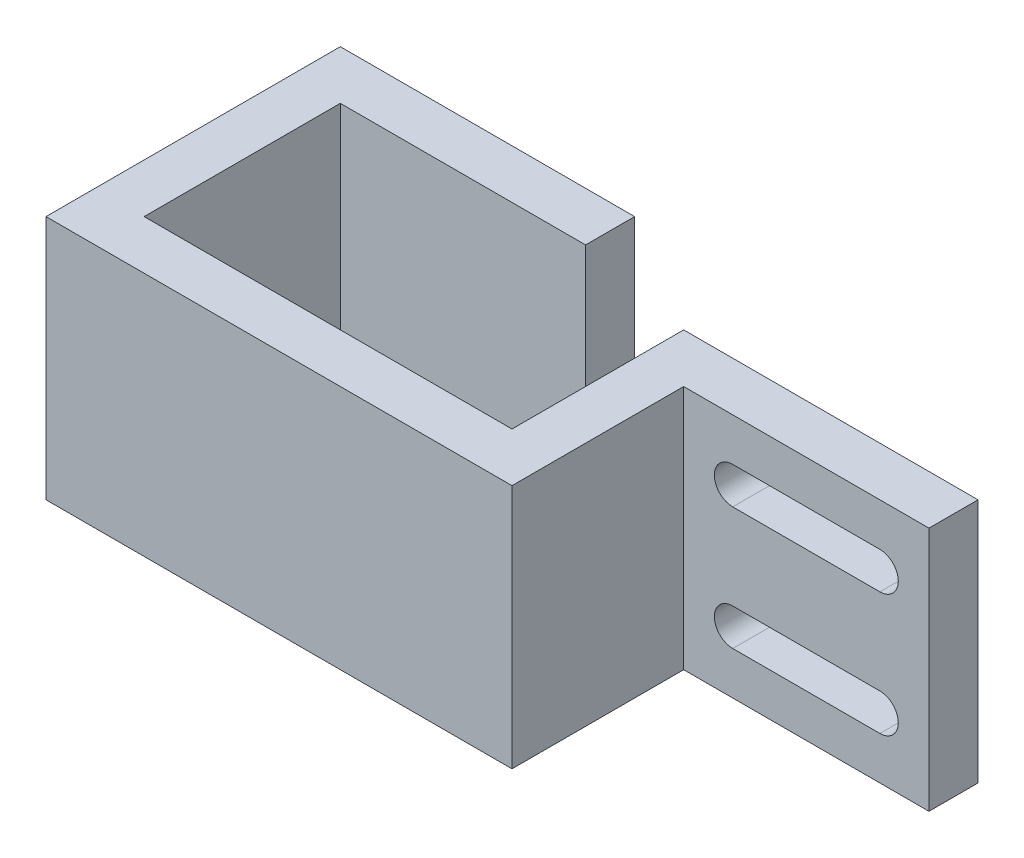
ISO-10303-21;
HEADER;
FILE_DESCRIPTION(('STEP AP214'),'2;1');
FILE_NAME('part.step','',(''),(''),'','','');
FILE_SCHEMA(('AUTOMOTIVE_DESIGN { 1 0 10303 214 1 1 1 1 }'));
ENDSEC;
DATA;
#1=APPLICATION_CONTEXT('core data for automotive mechanical design processes');
#2=APPLICATION_PROTOCOL_DEFINITION('international standard','automotive_design',2000,#1);
#3=PRODUCT_CONTEXT('',#1,'mechanical');
#4=PRODUCT('Part','Part','',(#3));
#5=PRODUCT_RELATED_PRODUCT_CATEGORY('part','',(#4));
#6=PRODUCT_DEFINITION_FORMATION('','',#4);
#7=PRODUCT_DEFINITION_CONTEXT('part definition',#1,'design');
#8=PRODUCT_DEFINITION('design','',#6,#7);
#9=PRODUCT_DEFINITION_SHAPE('','',#8);
#10=(LENGTH_UNIT() NAMED_UNIT(*) SI_UNIT(.MILLI.,.METRE.));
#11=(NAMED_UNIT(*) PLANE_ANGLE_UNIT() SI_UNIT($,.RADIAN.));
#12=(NAMED_UNIT(*) SI_UNIT($,.STERADIAN.) SOLID_ANGLE_UNIT());
#13=UNCERTAINTY_MEASURE_WITH_UNIT(LENGTH_MEASURE(1.E-05),#10,'distance_accuracy_value','');
#14=(GEOMETRIC_REPRESENTATION_CONTEXT(3) GLOBAL_UNCERTAINTY_ASSIGNED_CONTEXT((#13)) GLOBAL_UNIT_ASSIGNED_CONTEXT((#10,
#11,#12)) REPRESENTATION_CONTEXT('',''));
#15=CARTESIAN_POINT('',(0.,0.,0.));
#16=DIRECTION('',(0.,0.,1.));
#17=DIRECTION('',(1.,0.,0.));
#18=AXIS2_PLACEMENT_3D('',#15,#16,#17);
#19=CARTESIAN_POINT('',(-15.,20.,-24.));
#20=DIRECTION('',(-1.,0.,0.));
#21=DIRECTION('',(0.,0.,1.));
#22=AXIS2_PLACEMENT_3D('',#19,#20,#21);
#23=PLANE('',#22);
#24=DIRECTION('',(0.,-1.,0.));
#25=VECTOR('',#24,1.);
#26=CARTESIAN_POINT('',(-15.,20.,-20.));
#27=LINE('',#26,#25);
#28=CARTESIAN_POINT('',(-15.,20.,-20.));
#29=VERTEX_POINT('',#28);
#30=CARTESIAN_POINT('',(-15.,0.,-20.));
#31=VERTEX_POINT('',#30);
#32=EDGE_CURVE('E48',#29,#31,#27,.T.);
#33=ORIENTED_EDGE('',*,*,#32,.F.);
#34=DIRECTION('',(0.,0.,-1.));
#35=VECTOR('',#34,1.);
#36=CARTESIAN_POINT('',(-15.,20.,-24.));
#37=LINE('',#36,#35);
#38=CARTESIAN_POINT('',(-15.,20.,-4.));
#39=VERTEX_POINT('',#38);
#40=EDGE_CURVE('E180',#39,#29,#37,.T.);
#41=ORIENTED_EDGE('',*,*,#40,.F.);
#42=DIRECTION('',(0.,-1.,0.));
#43=VECTOR('',#42,1.);
#44=CARTESIAN_POINT('',(-15.,20.,-4.));
#45=LINE('',#44,#43);
#46=CARTESIAN_POINT('',(-15.,0.,-4.));
#47=VERTEX_POINT('',#46);
#48=EDGE_CURVE('E282',#39,#47,#45,.T.);
#49=ORIENTED_EDGE('',*,*,#48,.T.);
#50=DIRECTION('',(0.,0.,-1.));
#51=VECTOR('',#50,1.);
#52=CARTESIAN_POINT('',(-15.,0.,-24.));
#53=LINE('',#52,#51);
#54=EDGE_CURVE('E53',#47,#31,#53,.T.);
#55=ORIENTED_EDGE('',*,*,#54,.T.);
#56=EDGE_LOOP('',(#33,#41,#49,#55));
#57=FACE_BOUND('',#56,.T.);
#58=ADVANCED_FACE('F33',(#57),#23,.F.);
#59=CARTESIAN_POINT('',(-19.,20.,0.));
#60=DIRECTION('',(1.,0.,0.));
#61=DIRECTION('',(0.,0.,-1.));
#62=AXIS2_PLACEMENT_3D('',#59,#60,#61);
#63=PLANE('',#62);
#64=DIRECTION('',(0.,0.,1.));
#65=VECTOR('',#64,1.);
#66=CARTESIAN_POINT('',(-19.,0.,0.));
#67=LINE('',#66,#65);
#68=CARTESIAN_POINT('',(-19.,0.,-24.));
#69=VERTEX_POINT('',#68);
#70=CARTESIAN_POINT('',(-19.,0.,0.));
#71=VERTEX_POINT('',#70);
#72=EDGE_CURVE('E220',#69,#71,#67,.T.);
#73=ORIENTED_EDGE('',*,*,#72,.T.);
#74=DIRECTION('',(0.,-1.,0.));
#75=VECTOR('',#74,1.);
#76=CARTESIAN_POINT('',(-19.,20.,0.));
#77=LINE('',#76,#75);
#78=CARTESIAN_POINT('',(-19.,20.,0.));
#79=VERTEX_POINT('',#78);
#80=EDGE_CURVE('E302',#79,#71,#77,.T.);
#81=ORIENTED_EDGE('',*,*,#80,.F.);
#82=DIRECTION('',(0.,0.,1.));
#83=VECTOR('',#82,1.);
#84=CARTESIAN_POINT('',(-19.,20.,0.));
#85=LINE('',#84,#83);
#86=CARTESIAN_POINT('',(-19.,20.,-24.));
#87=VERTEX_POINT('',#86);
#88=EDGE_CURVE('E245',#87,#79,#85,.T.);
#89=ORIENTED_EDGE('',*,*,#88,.F.);
#90=DIRECTION('',(0.,-1.,0.));
#91=VECTOR('',#90,1.);
#92=CARTESIAN_POINT('',(-19.,20.,-24.));
#93=LINE('',#92,#91);
#94=EDGE_CURVE('E176',#87,#69,#93,.T.);
#95=ORIENTED_EDGE('',*,*,#94,.T.);
#96=EDGE_LOOP('',(#73,#81,#89,#95));
#97=FACE_BOUND('',#96,.T.);
#98=ADVANCED_FACE('F35',(#97),#63,.F.);
#99=CARTESIAN_POINT('',(19.,20.,0.));
#100=DIRECTION('',(0.,0.,-1.));
#101=DIRECTION('',(-1.,0.,0.));
#102=AXIS2_PLACEMENT_3D('',#99,#100,#101);
#103=PLANE('',#102);
#104=DIRECTION('',(1.,0.,0.));
#105=VECTOR('',#104,1.);
#106=CARTESIAN_POINT('',(19.,0.,0.));
#107=LINE('',#106,#105);
#108=CARTESIAN_POINT('',(19.,0.,0.));
#109=VERTEX_POINT('',#108);
#110=EDGE_CURVE('E265',#71,#109,#107,.T.);
#111=ORIENTED_EDGE('',*,*,#110,.T.);
#112=DIRECTION('',(0.,-1.,0.));
#113=VECTOR('',#112,1.);
#114=CARTESIAN_POINT('',(19.,20.,0.));
#115=LINE('',#114,#113);
#116=CARTESIAN_POINT('',(19.,20.,0.));
#117=VERTEX_POINT('',#116);
#118=EDGE_CURVE('E299',#117,#109,#115,.T.);
#119=ORIENTED_EDGE('',*,*,#118,.F.);
#120=DIRECTION('',(1.,0.,0.));
#121=VECTOR('',#120,1.);
#122=CARTESIAN_POINT('',(19.,20.,0.));
#123=LINE('',#122,#121);
#124=EDGE_CURVE('E247',#79,#117,#123,.T.);
#125=ORIENTED_EDGE('',*,*,#124,.F.);
#126=ORIENTED_EDGE('',*,*,#80,.T.);
#127=EDGE_LOOP('',(#111,#119,#125,#126));
#128=FACE_BOUND('',#127,.T.);
#129=ADVANCED_FACE('F361',(#128),#103,.F.);
#130=CARTESIAN_POINT('',(19.,20.,-14.));
#131=DIRECTION('',(-1.,0.,0.));
#132=DIRECTION('',(0.,0.,1.));
#133=AXIS2_PLACEMENT_3D('',#130,#131,#132);
#134=PLANE('',#133);
#135=DIRECTION('',(0.,0.,-1.));
#136=VECTOR('',#135,1.);
#137=CARTESIAN_POINT('',(19.,0.,-14.));
#138=LINE('',#137,#136);
#139=CARTESIAN_POINT('',(19.,0.,-14.));
#140=VERTEX_POINT('',#139);
#141=EDGE_CURVE('E267',#109,#140,#138,.T.);
#142=ORIENTED_EDGE('',*,*,#141,.T.);
#143=DIRECTION('',(0.,-1.,0.));
#144=VECTOR('',#143,1.);
#145=CARTESIAN_POINT('',(19.,20.,-14.));
#146=LINE('',#145,#144);
#147=CARTESIAN_POINT('',(19.,20.,-14.));
#148=VERTEX_POINT('',#147);
#149=EDGE_CURVE('E296',#148,#140,#146,.T.);
#150=ORIENTED_EDGE('',*,*,#149,.F.);
#151=DIRECTION('',(0.,0.,-1.));
#152=VECTOR('',#151,1.);
#153=CARTESIAN_POINT('',(19.,20.,-14.));
#154=LINE('',#153,#152);
#155=EDGE_CURVE('E250',#117,#148,#154,.T.);
#156=ORIENTED_EDGE('',*,*,#155,.F.);
#157=ORIENTED_EDGE('',*,*,#118,.T.);
#158=EDGE_LOOP('',(#142,#150,#156,#157));
#159=FACE_BOUND('',#158,.T.);
#160=ADVANCED_FACE('F382',(#159),#134,.F.);
#161=CARTESIAN_POINT('',(39.,20.,-14.));
#162=DIRECTION('',(0.,0.,-1.));
#163=DIRECTION('',(-1.,0.,0.));
#164=AXIS2_PLACEMENT_3D('',#161,#162,#163);
#165=PLANE('',#164);
#166=DIRECTION('',(-1.,0.,0.));
#167=VECTOR('',#166,1.);
#168=CARTESIAN_POINT('',(35.,16.5,-14.));
#169=LINE('',#168,#167);
#170=CARTESIAN_POINT('',(35.,16.5,-14.));
#171=VERTEX_POINT('',#170);
#172=CARTESIAN_POINT('',(23.,16.5,-14.));
#173=VERTEX_POINT('',#172);
#174=EDGE_CURVE('E207',#171,#173,#169,.T.);
#175=ORIENTED_EDGE('',*,*,#174,.F.);
#176=CARTESIAN_POINT('',(35.,15.,-14.));
#177=DIRECTION('',(0.,0.,1.));
#178=DIRECTION('',(1.,0.,0.));
#179=AXIS2_PLACEMENT_3D('',#176,#177,#178);
#180=CIRCLE('',#179,1.5);
#181=CARTESIAN_POINT('',(35.,13.5,-14.));
#182=VERTEX_POINT('',#181);
#183=EDGE_CURVE('E205',#182,#171,#180,.T.);
#184=ORIENTED_EDGE('',*,*,#183,.F.);
#185=DIRECTION('',(1.,0.,0.));
#186=VECTOR('',#185,1.);
#187=CARTESIAN_POINT('',(35.,13.5,-14.));
#188=LINE('',#187,#186);
#189=CARTESIAN_POINT('',(23.,13.5,-14.));
#190=VERTEX_POINT('',#189);
#191=EDGE_CURVE('E214',#190,#182,#188,.T.);
#192=ORIENTED_EDGE('',*,*,#191,.F.);
#193=CARTESIAN_POINT('',(23.,15.,-14.));
#194=DIRECTION('',(0.,0.,1.));
#195=DIRECTION('',(-1.,0.,0.));
#196=AXIS2_PLACEMENT_3D('',#193,#194,#195);
#197=CIRCLE('',#196,1.5);
#198=EDGE_CURVE('E211',#173,#190,#197,.T.);
#199=ORIENTED_EDGE('',*,*,#198,.F.);
#200=EDGE_LOOP('',(#175,#184,#192,#199));
#201=FACE_BOUND('',#200,.T.);
#202=DIRECTION('',(-1.,0.,0.));
#203=VECTOR('',#202,1.);
#204=CARTESIAN_POINT('',(35.,6.50000000000001,-14.));
#205=LINE('',#204,#203);
#206=CARTESIAN_POINT('',(35.,6.50000000000001,-14.));
#207=VERTEX_POINT('',#206);
#208=CARTESIAN_POINT('',(23.,6.50000000000001,-14.));
#209=VERTEX_POINT('',#208);
#210=EDGE_CURVE('E228',#207,#209,#205,.T.);
#211=ORIENTED_EDGE('',*,*,#210,.F.);
#212=CARTESIAN_POINT('',(35.,5.,-14.));
#213=DIRECTION('',(0.,0.,1.));
#214=DIRECTION('',(-1.,0.,0.));
#215=AXIS2_PLACEMENT_3D('',#212,#213,#214);
#216=CIRCLE('',#215,1.5);
#217=CARTESIAN_POINT('',(35.,3.5,-14.));
#218=VERTEX_POINT('',#217);
#219=EDGE_CURVE('E204',#218,#207,#216,.T.);
#220=ORIENTED_EDGE('',*,*,#219,.F.);
#221=DIRECTION('',(1.,0.,0.));
#222=VECTOR('',#221,1.);
#223=CARTESIAN_POINT('',(35.,3.5,-14.));
#224=LINE('',#223,#222);
#225=CARTESIAN_POINT('',(23.,3.5,-14.));
#226=VERTEX_POINT('',#225);
#227=EDGE_CURVE('E234',#226,#218,#224,.T.);
#228=ORIENTED_EDGE('',*,*,#227,.F.);
#229=CARTESIAN_POINT('',(23.,5.,-14.));
#230=DIRECTION('',(0.,0.,1.));
#231=DIRECTION('',(1.,0.,0.));
#232=AXIS2_PLACEMENT_3D('',#229,#230,#231);
#233=CIRCLE('',#232,1.5);
#234=EDGE_CURVE('E231',#209,#226,#233,.T.);
#235=ORIENTED_EDGE('',*,*,#234,.F.);
#236=EDGE_LOOP('',(#211,#220,#228,#235));
#237=FACE_BOUND('',#236,.T.);
#238=DIRECTION('',(1.,0.,0.));
#239=VECTOR('',#238,1.);
#240=CARTESIAN_POINT('',(39.,0.,-14.));
#241=LINE('',#240,#239);
#242=CARTESIAN_POINT('',(39.,0.,-14.));
#243=VERTEX_POINT('',#242);
#244=EDGE_CURVE('E269',#140,#243,#241,.T.);
#245=ORIENTED_EDGE('',*,*,#244,.T.);
#246=DIRECTION('',(0.,-1.,0.));
#247=VECTOR('',#246,1.);
#248=CARTESIAN_POINT('',(39.,20.,-14.));
#249=LINE('',#248,#247);
#250=CARTESIAN_POINT('',(39.,20.,-14.));
#251=VERTEX_POINT('',#250);
#252=EDGE_CURVE('E293',#251,#243,#249,.T.);
#253=ORIENTED_EDGE('',*,*,#252,.F.);
#254=DIRECTION('',(1.,0.,0.));
#255=VECTOR('',#254,1.);
#256=CARTESIAN_POINT('',(39.,20.,-14.));
#257=LINE('',#256,#255);
#258=EDGE_CURVE('E252',#148,#251,#257,.T.);
#259=ORIENTED_EDGE('',*,*,#258,.F.);
#260=ORIENTED_EDGE('',*,*,#149,.T.);
#261=EDGE_LOOP('',(#245,#253,#259,#260));
#262=FACE_BOUND('',#261,.T.);
#263=ADVANCED_FACE('F338',(#201,#237,#262),#165,.F.);
#264=CARTESIAN_POINT('',(39.,20.,-18.));
#265=DIRECTION('',(-1.,0.,0.));
#266=DIRECTION('',(0.,0.,1.));
#267=AXIS2_PLACEMENT_3D('',#264,#265,#266);
#268=PLANE('',#267);
#269=DIRECTION('',(0.,0.,-1.));
#270=VECTOR('',#269,1.);
#271=CARTESIAN_POINT('',(39.,0.,-18.));
#272=LINE('',#271,#270);
#273=CARTESIAN_POINT('',(39.,0.,-18.));
#274=VERTEX_POINT('',#273);
#275=EDGE_CURVE('E271',#243,#274,#272,.T.);
#276=ORIENTED_EDGE('',*,*,#275,.T.);
#277=DIRECTION('',(0.,-1.,0.));
#278=VECTOR('',#277,1.);
#279=CARTESIAN_POINT('',(39.,20.,-18.));
#280=LINE('',#279,#278);
#281=CARTESIAN_POINT('',(39.,20.,-18.));
#282=VERTEX_POINT('',#281);
#283=EDGE_CURVE('E290',#282,#274,#280,.T.);
#284=ORIENTED_EDGE('',*,*,#283,.F.);
#285=DIRECTION('',(0.,0.,-1.));
#286=VECTOR('',#285,1.);
#287=CARTESIAN_POINT('',(39.,20.,-18.));
#288=LINE('',#287,#286);
#289=EDGE_CURVE('E254',#251,#282,#288,.T.);
#290=ORIENTED_EDGE('',*,*,#289,.F.);
#291=ORIENTED_EDGE('',*,*,#252,.T.);
#292=EDGE_LOOP('',(#276,#284,#290,#291));
#293=FACE_BOUND('',#292,.T.);
#294=ADVANCED_FACE('F376',(#293),#268,.F.);
#295=CARTESIAN_POINT('',(15.,20.,-18.));
#296=DIRECTION('',(0.,0.,1.));
#297=DIRECTION('',(1.,0.,0.));
#298=AXIS2_PLACEMENT_3D('',#295,#296,#297);
#299=PLANE('',#298);
#300=DIRECTION('',(1.,0.,0.));
#301=VECTOR('',#300,1.);
#302=CARTESIAN_POINT('',(15.,13.5,-18.));
#303=LINE('',#302,#301);
#304=CARTESIAN_POINT('',(23.,13.5,-18.));
#305=VERTEX_POINT('',#304);
#306=CARTESIAN_POINT('',(35.,13.5,-18.));
#307=VERTEX_POINT('',#306);
#308=EDGE_CURVE('E41',#305,#307,#303,.T.);
#309=ORIENTED_EDGE('',*,*,#308,.T.);
#310=CARTESIAN_POINT('',(35.,15.,-18.));
#311=DIRECTION('',(0.,0.,1.));
#312=DIRECTION('',(1.,0.,0.));
#313=AXIS2_PLACEMENT_3D('',#310,#311,#312);
#314=CIRCLE('',#313,1.5);
#315=CARTESIAN_POINT('',(35.,16.5,-18.));
#316=VERTEX_POINT('',#315);
#317=EDGE_CURVE('E11',#307,#316,#314,.T.);
#318=ORIENTED_EDGE('',*,*,#317,.T.);
#319=DIRECTION('',(-1.,0.,0.));
#320=VECTOR('',#319,1.);
#321=CARTESIAN_POINT('',(15.,16.5,-18.));
#322=LINE('',#321,#320);
#323=CARTESIAN_POINT('',(23.,16.5,-18.));
#324=VERTEX_POINT('',#323);
#325=EDGE_CURVE('E317',#316,#324,#322,.T.);
#326=ORIENTED_EDGE('',*,*,#325,.T.);
#327=CARTESIAN_POINT('',(23.,15.,-18.));
#328=DIRECTION('',(0.,0.,1.));
#329=DIRECTION('',(1.,0.,0.));
#330=AXIS2_PLACEMENT_3D('',#327,#328,#329);
#331=CIRCLE('',#330,1.5);
#332=EDGE_CURVE('E320',#324,#305,#331,.T.);
#333=ORIENTED_EDGE('',*,*,#332,.T.);
#334=EDGE_LOOP('',(#309,#318,#326,#333));
#335=FACE_BOUND('',#334,.T.);
#336=DIRECTION('',(1.,0.,0.));
#337=VECTOR('',#336,1.);
#338=CARTESIAN_POINT('',(15.,3.5,-18.));
#339=LINE('',#338,#337);
#340=CARTESIAN_POINT('',(23.,3.5,-18.));
#341=VERTEX_POINT('',#340);
#342=CARTESIAN_POINT('',(35.,3.5,-18.));
#343=VERTEX_POINT('',#342);
#344=EDGE_CURVE('E311',#341,#343,#339,.T.);
#345=ORIENTED_EDGE('',*,*,#344,.T.);
#346=CARTESIAN_POINT('',(35.,5.,-18.));
#347=DIRECTION('',(0.,0.,1.));
#348=DIRECTION('',(1.,0.,0.));
#349=AXIS2_PLACEMENT_3D('',#346,#347,#348);
#350=CIRCLE('',#349,1.5);
#351=CARTESIAN_POINT('',(35.,6.50000000000001,-18.));
#352=VERTEX_POINT('',#351);
#353=EDGE_CURVE('E314',#343,#352,#350,.T.);
#354=ORIENTED_EDGE('',*,*,#353,.T.);
#355=DIRECTION('',(-1.,0.,0.));
#356=VECTOR('',#355,1.);
#357=CARTESIAN_POINT('',(15.,6.50000000000001,-18.));
#358=LINE('',#357,#356);
#359=CARTESIAN_POINT('',(23.,6.50000000000001,-18.));
#360=VERTEX_POINT('',#359);
#361=EDGE_CURVE('E305',#352,#360,#358,.T.);
#362=ORIENTED_EDGE('',*,*,#361,.T.);
#363=CARTESIAN_POINT('',(23.,5.,-18.));
#364=DIRECTION('',(0.,0.,1.));
#365=DIRECTION('',(1.,0.,0.));
#366=AXIS2_PLACEMENT_3D('',#363,#364,#365);
#367=CIRCLE('',#366,1.5);
#368=EDGE_CURVE('E308',#360,#341,#367,.T.);
#369=ORIENTED_EDGE('',*,*,#368,.T.);
#370=EDGE_LOOP('',(#345,#354,#362,#369));
#371=FACE_BOUND('',#370,.T.);
#372=DIRECTION('',(-1.,0.,0.));
#373=VECTOR('',#372,1.);
#374=CARTESIAN_POINT('',(15.,0.,-18.));
#375=LINE('',#374,#373);
#376=CARTESIAN_POINT('',(15.,0.,-18.));
#377=VERTEX_POINT('',#376);
#378=EDGE_CURVE('E273',#274,#377,#375,.T.);
#379=ORIENTED_EDGE('',*,*,#378,.T.);
#380=DIRECTION('',(0.,-1.,0.));
#381=VECTOR('',#380,1.);
#382=CARTESIAN_POINT('',(15.,20.,-18.));
#383=LINE('',#382,#381);
#384=CARTESIAN_POINT('',(15.,20.,-18.));
#385=VERTEX_POINT('',#384);
#386=EDGE_CURVE('E287',#385,#377,#383,.T.);
#387=ORIENTED_EDGE('',*,*,#386,.F.);
#388=DIRECTION('',(-1.,0.,0.));
#389=VECTOR('',#388,1.);
#390=CARTESIAN_POINT('',(15.,20.,-18.));
#391=LINE('',#390,#389);
#392=EDGE_CURVE('E256',#282,#385,#391,.T.);
#393=ORIENTED_EDGE('',*,*,#392,.F.);
#394=ORIENTED_EDGE('',*,*,#283,.T.);
#395=EDGE_LOOP('',(#379,#387,#393,#394));
#396=FACE_BOUND('',#395,.T.);
#397=ADVANCED_FACE('F324',(#335,#371,#396),#299,.F.);
#398=CARTESIAN_POINT('',(15.,20.,-4.));
#399=DIRECTION('',(1.,0.,0.));
#400=DIRECTION('',(0.,0.,-1.));
#401=AXIS2_PLACEMENT_3D('',#398,#399,#400);
#402=PLANE('',#401);
#403=DIRECTION('',(0.,0.,1.));
#404=VECTOR('',#403,1.);
#405=CARTESIAN_POINT('',(15.,0.,-4.));
#406=LINE('',#405,#404);
#407=CARTESIAN_POINT('',(15.,0.,-4.));
#408=VERTEX_POINT('',#407);
#409=EDGE_CURVE('E275',#377,#408,#406,.T.);
#410=ORIENTED_EDGE('',*,*,#409,.T.);
#411=DIRECTION('',(0.,-1.,0.));
#412=VECTOR('',#411,1.);
#413=CARTESIAN_POINT('',(15.,20.,-4.));
#414=LINE('',#413,#412);
#415=CARTESIAN_POINT('',(15.,20.,-4.));
#416=VERTEX_POINT('',#415);
#417=EDGE_CURVE('E284',#416,#408,#414,.T.);
#418=ORIENTED_EDGE('',*,*,#417,.F.);
#419=DIRECTION('',(0.,0.,1.));
#420=VECTOR('',#419,1.);
#421=CARTESIAN_POINT('',(15.,20.,-4.));
#422=LINE('',#421,#420);
#423=EDGE_CURVE('E258',#385,#416,#422,.T.);
#424=ORIENTED_EDGE('',*,*,#423,.F.);
#425=ORIENTED_EDGE('',*,*,#386,.T.);
#426=EDGE_LOOP('',(#410,#418,#424,#425));
#427=FACE_BOUND('',#426,.T.);
#428=ADVANCED_FACE('F369',(#427),#402,.F.);
#429=CARTESIAN_POINT('',(-15.,20.,-4.));
#430=DIRECTION('',(0.,0.,1.));
#431=DIRECTION('',(1.,0.,0.));
#432=AXIS2_PLACEMENT_3D('',#429,#430,#431);
#433=PLANE('',#432);
#434=DIRECTION('',(-1.,0.,0.));
#435=VECTOR('',#434,1.);
#436=CARTESIAN_POINT('',(-15.,0.,-4.));
#437=LINE('',#436,#435);
#438=EDGE_CURVE('E277',#408,#47,#437,.T.);
#439=ORIENTED_EDGE('',*,*,#438,.T.);
#440=ORIENTED_EDGE('',*,*,#48,.F.);
#441=DIRECTION('',(-1.,0.,0.));
#442=VECTOR('',#441,1.);
#443=CARTESIAN_POINT('',(-15.,20.,-4.));
#444=LINE('',#443,#442);
#445=EDGE_CURVE('E260',#416,#39,#444,.T.);
#446=ORIENTED_EDGE('',*,*,#445,.F.);
#447=ORIENTED_EDGE('',*,*,#417,.T.);
#448=EDGE_LOOP('',(#439,#440,#446,#447));
#449=FACE_BOUND('',#448,.T.);
#450=ADVANCED_FACE('F366',(#449),#433,.F.);
#451=CARTESIAN_POINT('',(-19.,20.,-24.));
#452=DIRECTION('',(0.,0.,1.));
#453=DIRECTION('',(1.,0.,0.));
#454=AXIS2_PLACEMENT_3D('',#451,#452,#453);
#455=PLANE('',#454);
#456=DIRECTION('',(-1.,0.,0.));
#457=VECTOR('',#456,1.);
#458=CARTESIAN_POINT('',(-19.,0.,-24.));
#459=LINE('',#458,#457);
#460=CARTESIAN_POINT('',(5.,0.,-24.));
#461=VERTEX_POINT('',#460);
#462=EDGE_CURVE('E248',#461,#69,#459,.T.);
#463=ORIENTED_EDGE('',*,*,#462,.T.);
#464=ORIENTED_EDGE('',*,*,#94,.F.);
#465=DIRECTION('',(-1.,0.,0.));
#466=VECTOR('',#465,1.);
#467=CARTESIAN_POINT('',(-19.,20.,-24.));
#468=LINE('',#467,#466);
#469=CARTESIAN_POINT('',(5.,20.,-24.));
#470=VERTEX_POINT('',#469);
#471=EDGE_CURVE('E170',#470,#87,#468,.T.);
#472=ORIENTED_EDGE('',*,*,#471,.F.);
#473=DIRECTION('',(0.,1.,0.));
#474=VECTOR('',#473,1.);
#475=CARTESIAN_POINT('',(5.,0.,-24.));
#476=LINE('',#475,#474);
#477=EDGE_CURVE('E174',#461,#470,#476,.T.);
#478=ORIENTED_EDGE('',*,*,#477,.F.);
#479=EDGE_LOOP('',(#463,#464,#472,#478));
#480=FACE_BOUND('',#479,.T.);
#481=ADVANCED_FACE('F172',(#480),#455,.F.);
#482=CARTESIAN_POINT('',(0.,20.,0.));
#483=DIRECTION('',(0.,-1.,0.));
#484=DIRECTION('',(0.,0.,-1.));
#485=AXIS2_PLACEMENT_3D('',#482,#483,#484);
#486=PLANE('',#485);
#487=ORIENTED_EDGE('',*,*,#88,.T.);
#488=ORIENTED_EDGE('',*,*,#124,.T.);
#489=ORIENTED_EDGE('',*,*,#155,.T.);
#490=ORIENTED_EDGE('',*,*,#258,.T.);
#491=ORIENTED_EDGE('',*,*,#289,.T.);
#492=ORIENTED_EDGE('',*,*,#392,.T.);
#493=ORIENTED_EDGE('',*,*,#423,.T.);
#494=ORIENTED_EDGE('',*,*,#445,.T.);
#495=ORIENTED_EDGE('',*,*,#40,.T.);
#496=DIRECTION('',(-1.,0.,0.));
#497=VECTOR('',#496,1.);
#498=CARTESIAN_POINT('',(5.,20.,-20.));
#499=LINE('',#498,#497);
#500=CARTESIAN_POINT('',(5.,20.,-20.));
#501=VERTEX_POINT('',#500);
#502=EDGE_CURVE('E186',#501,#29,#499,.T.);
#503=ORIENTED_EDGE('',*,*,#502,.F.);
#504=DIRECTION('',(0.,0.,1.));
#505=VECTOR('',#504,1.);
#506=CARTESIAN_POINT('',(5.,20.,-24.));
#507=LINE('',#506,#505);
#508=EDGE_CURVE('E183',#470,#501,#507,.T.);
#509=ORIENTED_EDGE('',*,*,#508,.F.);
#510=ORIENTED_EDGE('',*,*,#471,.T.);
#511=EDGE_LOOP('',(#487,#488,#489,#490,#491,#492,#493,#494,#495,#503,#509,#510));
#512=FACE_BOUND('',#511,.T.);
#513=ADVANCED_FACE('F184',(#512),#486,.F.);
#514=CARTESIAN_POINT('',(0.,0.,0.));
#515=DIRECTION('',(0.,-1.,0.));
#516=DIRECTION('',(0.,0.,-1.));
#517=AXIS2_PLACEMENT_3D('',#514,#515,#516);
#518=PLANE('',#517);
#519=ORIENTED_EDGE('',*,*,#72,.F.);
#520=ORIENTED_EDGE('',*,*,#462,.F.);
#521=DIRECTION('',(0.,0.,-1.));
#522=VECTOR('',#521,1.);
#523=CARTESIAN_POINT('',(5.,0.,-20.));
#524=LINE('',#523,#522);
#525=CARTESIAN_POINT('',(5.,0.,-20.));
#526=VERTEX_POINT('',#525);
#527=EDGE_CURVE('E194',#526,#461,#524,.T.);
#528=ORIENTED_EDGE('',*,*,#527,.F.);
#529=DIRECTION('',(-1.,0.,0.));
#530=VECTOR('',#529,1.);
#531=CARTESIAN_POINT('',(5.,0.,-20.));
#532=LINE('',#531,#530);
#533=EDGE_CURVE('E199',#526,#31,#532,.T.);
#534=ORIENTED_EDGE('',*,*,#533,.T.);
#535=ORIENTED_EDGE('',*,*,#54,.F.);
#536=ORIENTED_EDGE('',*,*,#438,.F.);
#537=ORIENTED_EDGE('',*,*,#409,.F.);
#538=ORIENTED_EDGE('',*,*,#378,.F.);
#539=ORIENTED_EDGE('',*,*,#275,.F.);
#540=ORIENTED_EDGE('',*,*,#244,.F.);
#541=ORIENTED_EDGE('',*,*,#141,.F.);
#542=ORIENTED_EDGE('',*,*,#110,.F.);
#543=EDGE_LOOP('',(#519,#520,#528,#534,#535,#536,#537,#538,#539,#540,#541,#542));
#544=FACE_BOUND('',#543,.T.);
#545=ADVANCED_FACE('F397',(#544),#518,.T.);
#546=CARTESIAN_POINT('',(35.,5.,-34.));
#547=DIRECTION('',(0.,0.,1.));
#548=DIRECTION('',(1.,0.,0.));
#549=AXIS2_PLACEMENT_3D('',#546,#547,#548);
#550=CYLINDRICAL_SURFACE('',#549,1.5);
#551=DIRECTION('',(0.,0.,1.));
#552=VECTOR('',#551,1.);
#553=CARTESIAN_POINT('',(35.,3.5,-34.));
#554=LINE('',#553,#552);
#555=EDGE_CURVE('E208',#343,#218,#554,.T.);
#556=ORIENTED_EDGE('',*,*,#555,.T.);
#557=ORIENTED_EDGE('',*,*,#219,.T.);
#558=DIRECTION('',(0.,0.,1.));
#559=VECTOR('',#558,1.);
#560=CARTESIAN_POINT('',(35.,6.50000000000001,-34.));
#561=LINE('',#560,#559);
#562=EDGE_CURVE('E237',#352,#207,#561,.T.);
#563=ORIENTED_EDGE('',*,*,#562,.F.);
#564=ORIENTED_EDGE('',*,*,#353,.F.);
#565=EDGE_LOOP('',(#556,#557,#563,#564));
#566=FACE_BOUND('',#565,.T.);
#567=ADVANCED_FACE('F416',(#566),#550,.F.);
#568=CARTESIAN_POINT('',(35.,3.5,-34.));
#569=DIRECTION('',(0.,-1.,0.));
#570=DIRECTION('',(1.,0.,0.));
#571=AXIS2_PLACEMENT_3D('',#568,#569,#570);
#572=PLANE('',#571);
#573=DIRECTION('',(0.,0.,1.));
#574=VECTOR('',#573,1.);
#575=CARTESIAN_POINT('',(23.,3.5,-34.));
#576=LINE('',#575,#574);
#577=EDGE_CURVE('E239',#341,#226,#576,.T.);
#578=ORIENTED_EDGE('',*,*,#577,.T.);
#579=ORIENTED_EDGE('',*,*,#227,.T.);
#580=ORIENTED_EDGE('',*,*,#555,.F.);
#581=ORIENTED_EDGE('',*,*,#344,.F.);
#582=EDGE_LOOP('',(#578,#579,#580,#581));
#583=FACE_BOUND('',#582,.T.);
#584=ADVANCED_FACE('F421',(#583),#572,.F.);
#585=CARTESIAN_POINT('',(23.,5.,-34.));
#586=DIRECTION('',(0.,0.,1.));
#587=DIRECTION('',(1.,0.,0.));
#588=AXIS2_PLACEMENT_3D('',#585,#586,#587);
#589=CYLINDRICAL_SURFACE('',#588,1.5);
#590=DIRECTION('',(0.,0.,1.));
#591=VECTOR('',#590,1.);
#592=CARTESIAN_POINT('',(23.,6.50000000000001,-34.));
#593=LINE('',#592,#591);
#594=EDGE_CURVE('E241',#360,#209,#593,.T.);
#595=ORIENTED_EDGE('',*,*,#594,.T.);
#596=ORIENTED_EDGE('',*,*,#234,.T.);
#597=ORIENTED_EDGE('',*,*,#577,.F.);
#598=ORIENTED_EDGE('',*,*,#368,.F.);
#599=EDGE_LOOP('',(#595,#596,#597,#598));
#600=FACE_BOUND('',#599,.T.);
#601=ADVANCED_FACE('F429',(#600),#589,.F.);
#602=CARTESIAN_POINT('',(35.,6.50000000000001,-34.));
#603=DIRECTION('',(0.,1.,0.));
#604=DIRECTION('',(-1.,0.,0.));
#605=AXIS2_PLACEMENT_3D('',#602,#603,#604);
#606=PLANE('',#605);
#607=ORIENTED_EDGE('',*,*,#562,.T.);
#608=ORIENTED_EDGE('',*,*,#210,.T.);
#609=ORIENTED_EDGE('',*,*,#594,.F.);
#610=ORIENTED_EDGE('',*,*,#361,.F.);
#611=EDGE_LOOP('',(#607,#608,#609,#610));
#612=FACE_BOUND('',#611,.T.);
#613=ADVANCED_FACE('F426',(#612),#606,.F.);
#614=CARTESIAN_POINT('',(35.,15.,-34.));
#615=DIRECTION('',(0.,0.,1.));
#616=DIRECTION('',(1.,0.,0.));
#617=AXIS2_PLACEMENT_3D('',#614,#615,#616);
#618=CYLINDRICAL_SURFACE('',#617,1.5);
#619=DIRECTION('',(0.,0.,1.));
#620=VECTOR('',#619,1.);
#621=CARTESIAN_POINT('',(35.,13.5,-34.));
#622=LINE('',#621,#620);
#623=EDGE_CURVE('E218',#307,#182,#622,.T.);
#624=ORIENTED_EDGE('',*,*,#623,.T.);
#625=ORIENTED_EDGE('',*,*,#183,.T.);
#626=DIRECTION('',(0.,0.,1.));
#627=VECTOR('',#626,1.);
#628=CARTESIAN_POINT('',(35.,16.5,-34.));
#629=LINE('',#628,#627);
#630=EDGE_CURVE('E217',#316,#171,#629,.T.);
#631=ORIENTED_EDGE('',*,*,#630,.F.);
#632=ORIENTED_EDGE('',*,*,#317,.F.);
#633=EDGE_LOOP('',(#624,#625,#631,#632));
#634=FACE_BOUND('',#633,.T.);
#635=ADVANCED_FACE('F342',(#634),#618,.F.);
#636=CARTESIAN_POINT('',(35.,13.5,-34.));
#637=DIRECTION('',(0.,-1.,0.));
#638=DIRECTION('',(1.,0.,0.));
#639=AXIS2_PLACEMENT_3D('',#636,#637,#638);
#640=PLANE('',#639);
#641=DIRECTION('',(0.,0.,1.));
#642=VECTOR('',#641,1.);
#643=CARTESIAN_POINT('',(23.,13.5,-34.));
#644=LINE('',#643,#642);
#645=EDGE_CURVE('E221',#305,#190,#644,.T.);
#646=ORIENTED_EDGE('',*,*,#645,.T.);
#647=ORIENTED_EDGE('',*,*,#191,.T.);
#648=ORIENTED_EDGE('',*,*,#623,.F.);
#649=ORIENTED_EDGE('',*,*,#308,.F.);
#650=EDGE_LOOP('',(#646,#647,#648,#649));
#651=FACE_BOUND('',#650,.T.);
#652=ADVANCED_FACE('F330',(#651),#640,.F.);
#653=CARTESIAN_POINT('',(23.,15.,-34.));
#654=DIRECTION('',(0.,0.,1.));
#655=DIRECTION('',(1.,0.,0.));
#656=AXIS2_PLACEMENT_3D('',#653,#654,#655);
#657=CYLINDRICAL_SURFACE('',#656,1.5);
#658=DIRECTION('',(0.,0.,1.));
#659=VECTOR('',#658,1.);
#660=CARTESIAN_POINT('',(23.,16.5,-34.));
#661=LINE('',#660,#659);
#662=EDGE_CURVE('E223',#324,#173,#661,.T.);
#663=ORIENTED_EDGE('',*,*,#662,.T.);
#664=ORIENTED_EDGE('',*,*,#198,.T.);
#665=ORIENTED_EDGE('',*,*,#645,.F.);
#666=ORIENTED_EDGE('',*,*,#332,.F.);
#667=EDGE_LOOP('',(#663,#664,#665,#666));
#668=FACE_BOUND('',#667,.T.);
#669=ADVANCED_FACE('F332',(#668),#657,.F.);
#670=CARTESIAN_POINT('',(35.,16.5,-34.));
#671=DIRECTION('',(0.,1.,0.));
#672=DIRECTION('',(-1.,0.,0.));
#673=AXIS2_PLACEMENT_3D('',#670,#671,#672);
#674=PLANE('',#673);
#675=ORIENTED_EDGE('',*,*,#630,.T.);
#676=ORIENTED_EDGE('',*,*,#174,.T.);
#677=ORIENTED_EDGE('',*,*,#662,.F.);
#678=ORIENTED_EDGE('',*,*,#325,.F.);
#679=EDGE_LOOP('',(#675,#676,#677,#678));
#680=FACE_BOUND('',#679,.T.);
#681=ADVANCED_FACE('F344',(#680),#674,.F.);
#682=CARTESIAN_POINT('',(5.,20.,-20.));
#683=DIRECTION('',(0.,0.,-1.));
#684=DIRECTION('',(0.,1.,0.));
#685=AXIS2_PLACEMENT_3D('',#682,#683,#684);
#686=PLANE('',#685);
#687=ORIENTED_EDGE('',*,*,#32,.T.);
#688=ORIENTED_EDGE('',*,*,#533,.F.);
#689=DIRECTION('',(0.,-1.,0.));
#690=VECTOR('',#689,1.);
#691=CARTESIAN_POINT('',(5.,20.,-20.));
#692=LINE('',#691,#690);
#693=EDGE_CURVE('E189',#501,#526,#692,.T.);
#694=ORIENTED_EDGE('',*,*,#693,.F.);
#695=ORIENTED_EDGE('',*,*,#502,.T.);
#696=EDGE_LOOP('',(#687,#688,#694,#695));
#697=FACE_BOUND('',#696,.T.);
#698=ADVANCED_FACE('F346',(#697),#686,.F.);
#699=CARTESIAN_POINT('',(5.,0.,0.));
#700=DIRECTION('',(1.,0.,0.));
#701=DIRECTION('',(0.,0.,-1.));
#702=AXIS2_PLACEMENT_3D('',#699,#700,#701);
#703=PLANE('',#702);
#704=ORIENTED_EDGE('',*,*,#477,.T.);
#705=ORIENTED_EDGE('',*,*,#508,.T.);
#706=ORIENTED_EDGE('',*,*,#693,.T.);
#707=ORIENTED_EDGE('',*,*,#527,.T.);
#708=EDGE_LOOP('',(#704,#705,#706,#707));
#709=FACE_BOUND('',#708,.T.);
#710=ADVANCED_FACE('F192',(#709),#703,.T.);
#711=CLOSED_SHELL('',(#58,#98,#129,#160,#263,#294,#397,#428,#450,#481,#513,#545,#567,#584,#601,
#613,#635,#652,#669,#681,#698,#710));
#712=MANIFOLD_SOLID_BREP('B2',#711);
#713=ADVANCED_BREP_SHAPE_REPRESENTATION('',(#18,#712),#14);
#714=SHAPE_DEFINITION_REPRESENTATION(#9,#713);
ENDSEC;
END-ISO-10303-21;
